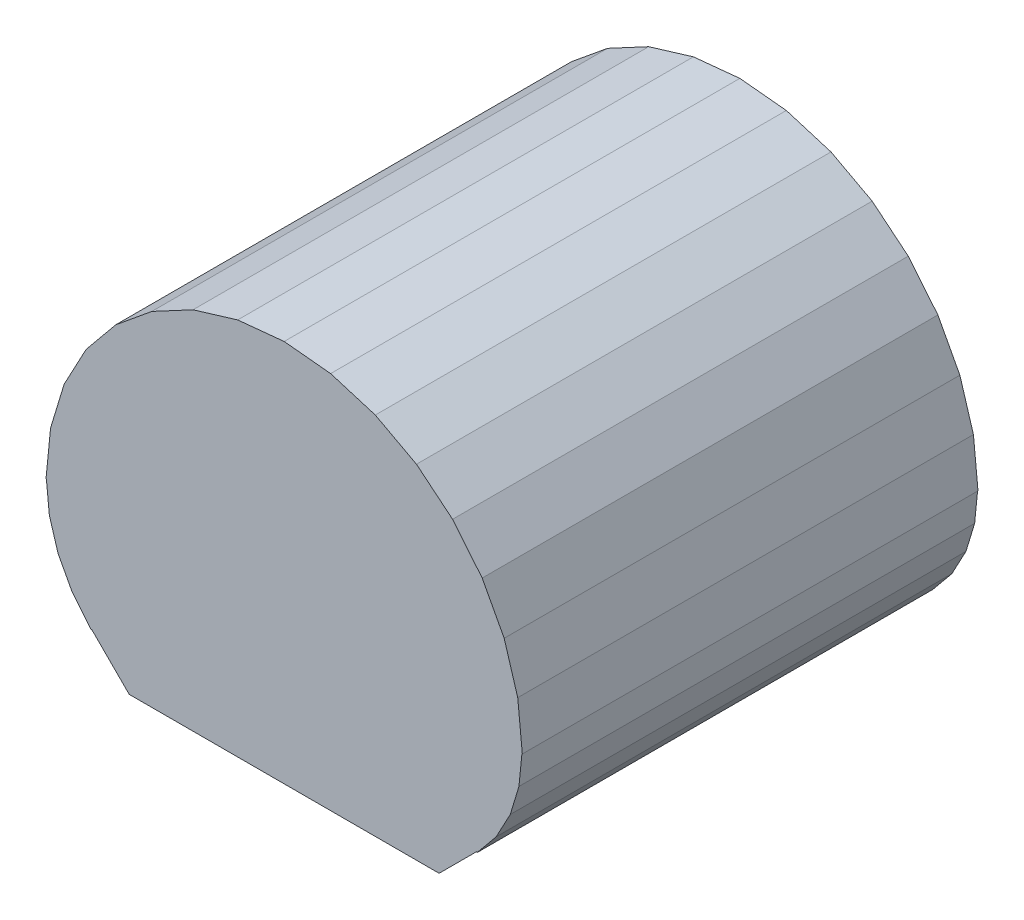
ISO-10303-21;
HEADER;
FILE_DESCRIPTION(('STEP AP214'),'2;1');
FILE_NAME('part.step','',(''),(''),'','','');
FILE_SCHEMA(('AUTOMOTIVE_DESIGN { 1 0 10303 214 1 1 1 1 }'));
ENDSEC;
DATA;
#1=APPLICATION_CONTEXT('core data for automotive mechanical design processes');
#2=APPLICATION_PROTOCOL_DEFINITION('international standard','automotive_design',2000,#1);
#3=PRODUCT_CONTEXT('',#1,'mechanical');
#4=PRODUCT('Part','Part','',(#3));
#5=PRODUCT_RELATED_PRODUCT_CATEGORY('part','',(#4));
#6=PRODUCT_DEFINITION_FORMATION('','',#4);
#7=PRODUCT_DEFINITION_CONTEXT('part definition',#1,'design');
#8=PRODUCT_DEFINITION('design','',#6,#7);
#9=PRODUCT_DEFINITION_SHAPE('','',#8);
#10=(LENGTH_UNIT() NAMED_UNIT(*) SI_UNIT(.MILLI.,.METRE.));
#11=(NAMED_UNIT(*) PLANE_ANGLE_UNIT() SI_UNIT($,.RADIAN.));
#12=(NAMED_UNIT(*) SI_UNIT($,.STERADIAN.) SOLID_ANGLE_UNIT());
#13=UNCERTAINTY_MEASURE_WITH_UNIT(LENGTH_MEASURE(1.E-05),#10,'distance_accuracy_value','');
#14=(GEOMETRIC_REPRESENTATION_CONTEXT(3) GLOBAL_UNCERTAINTY_ASSIGNED_CONTEXT((#13)) GLOBAL_UNIT_ASSIGNED_CONTEXT((#10,
#11,#12)) REPRESENTATION_CONTEXT('',''));
#15=CARTESIAN_POINT('',(0.,0.,0.));
#16=DIRECTION('',(0.,0.,1.));
#17=DIRECTION('',(1.,0.,0.));
#18=AXIS2_PLACEMENT_3D('',#15,#16,#17);
#19=CARTESIAN_POINT('',(0.,2.10181952,0.));
#20=DIRECTION('',(0.0980190132252092,0.995184542206297,0.));
#21=DIRECTION('',(-0.995184542206297,0.0980190132252092,0.));
#22=AXIS2_PLACEMENT_3D('',#19,#20,#21);
#23=PLANE('',#22);
#24=DIRECTION('',(0.,0.,1.));
#25=VECTOR('',#24,1.);
#26=CARTESIAN_POINT('',(0.50978816,2.0516088,0.));
#27=LINE('',#26,#25);
#28=CARTESIAN_POINT('',(0.509788159999998,2.05160879999998,0.));
#29=VERTEX_POINT('',#28);
#30=CARTESIAN_POINT('',(0.509788159999998,2.05160879999998,5.00000016));
#31=VERTEX_POINT('',#30);
#32=EDGE_CURVE('E602',#29,#31,#27,.T.);
#33=ORIENTED_EDGE('',*,*,#32,.F.);
#34=DIRECTION('',(-0.995184542206297,0.0980190132252092,0.));
#35=VECTOR('',#34,1.);
#36=CARTESIAN_POINT('',(0.,2.10181952,0.));
#37=LINE('',#36,#35);
#38=CARTESIAN_POINT('',(0.,2.10181952000003,0.));
#39=VERTEX_POINT('',#38);
#40=EDGE_CURVE('E616',#29,#39,#37,.T.);
#41=ORIENTED_EDGE('',*,*,#40,.T.);
#42=DIRECTION('',(0.,0.,1.));
#43=VECTOR('',#42,1.);
#44=CARTESIAN_POINT('',(0.,2.10181952000005,0.));
#45=LINE('',#44,#43);
#46=CARTESIAN_POINT('',(0.,2.10181952000003,5.00000016));
#47=VERTEX_POINT('',#46);
#48=EDGE_CURVE('E611',#47,#39,#45,.F.);
#49=ORIENTED_EDGE('',*,*,#48,.F.);
#50=DIRECTION('',(-0.995184542206297,0.0980190132252092,0.));
#51=VECTOR('',#50,1.);
#52=CARTESIAN_POINT('',(0.,2.10181952,5.00000016));
#53=LINE('',#52,#51);
#54=EDGE_CURVE('E624',#47,#31,#53,.F.);
#55=ORIENTED_EDGE('',*,*,#54,.T.);
#56=EDGE_LOOP('',(#33,#41,#49,#55));
#57=FACE_BOUND('',#56,.T.);
#58=ADVANCED_FACE('F16',(#57),#23,.T.);
#59=CARTESIAN_POINT('',(-0.50978816,2.0516088,0.));
#60=DIRECTION('',(-0.0980190132252092,0.995184542206297,0.));
#61=DIRECTION('',(-0.995184542206297,-0.0980190132252092,0.));
#62=AXIS2_PLACEMENT_3D('',#59,#60,#61);
#63=PLANE('',#62);
#64=ORIENTED_EDGE('',*,*,#48,.T.);
#65=DIRECTION('',(-0.995184542206297,-0.0980190132252092,0.));
#66=VECTOR('',#65,1.);
#67=CARTESIAN_POINT('',(-0.50978816,2.0516088,0.));
#68=LINE('',#67,#66);
#69=CARTESIAN_POINT('',(-0.509788159999987,2.05160879999996,0.));
#70=VERTEX_POINT('',#69);
#71=EDGE_CURVE('E609',#39,#70,#68,.T.);
#72=ORIENTED_EDGE('',*,*,#71,.T.);
#73=DIRECTION('',(0.,0.,1.));
#74=VECTOR('',#73,1.);
#75=CARTESIAN_POINT('',(-0.509788159999981,2.05160879999994,0.));
#76=LINE('',#75,#74);
#77=CARTESIAN_POINT('',(-0.509788159999983,2.05160879999996,5.00000016));
#78=VERTEX_POINT('',#77);
#79=EDGE_CURVE('E584',#78,#70,#76,.F.);
#80=ORIENTED_EDGE('',*,*,#79,.F.);
#81=DIRECTION('',(-0.995184542206297,-0.0980190132252092,0.));
#82=VECTOR('',#81,1.);
#83=CARTESIAN_POINT('',(-0.50978816,2.0516088,5.00000016));
#84=LINE('',#83,#82);
#85=EDGE_CURVE('E614',#78,#47,#84,.F.);
#86=ORIENTED_EDGE('',*,*,#85,.T.);
#87=EDGE_LOOP('',(#64,#72,#80,#86));
#88=FACE_BOUND('',#87,.T.);
#89=ADVANCED_FACE('F637',(#88),#63,.T.);
#90=CARTESIAN_POINT('',(0.50978816,2.0516088,0.));
#91=DIRECTION('',(0.290282483393017,0.956941001230056,0.));
#92=DIRECTION('',(-0.956941001230056,0.290282483393017,0.));
#93=AXIS2_PLACEMENT_3D('',#90,#91,#92);
#94=PLANE('',#93);
#95=DIRECTION('',(0.,0.,1.));
#96=VECTOR('',#95,1.);
#97=CARTESIAN_POINT('',(0.99998784,1.90290958,0.));
#98=LINE('',#97,#96);
#99=CARTESIAN_POINT('',(0.999987840000006,1.90290958000002,0.));
#100=VERTEX_POINT('',#99);
#101=CARTESIAN_POINT('',(0.999987840000006,1.90290958000002,5.00000016));
#102=VERTEX_POINT('',#101);
#103=EDGE_CURVE('E575',#100,#102,#98,.T.);
#104=ORIENTED_EDGE('',*,*,#103,.F.);
#105=DIRECTION('',(-0.956941001230056,0.290282483393017,0.));
#106=VECTOR('',#105,1.);
#107=CARTESIAN_POINT('',(0.50978816,2.0516088,0.));
#108=LINE('',#107,#106);
#109=EDGE_CURVE('E589',#100,#29,#108,.T.);
#110=ORIENTED_EDGE('',*,*,#109,.T.);
#111=ORIENTED_EDGE('',*,*,#32,.T.);
#112=DIRECTION('',(-0.956941001230056,0.290282483393017,0.));
#113=VECTOR('',#112,1.);
#114=CARTESIAN_POINT('',(0.50978816,2.0516088,5.00000016));
#115=LINE('',#114,#113);
#116=EDGE_CURVE('E598',#31,#102,#115,.F.);
#117=ORIENTED_EDGE('',*,*,#116,.T.);
#118=EDGE_LOOP('',(#104,#110,#111,#117));
#119=FACE_BOUND('',#118,.T.);
#120=ADVANCED_FACE('F661',(#119),#94,.T.);
#121=CARTESIAN_POINT('',(-0.99998784,1.90290958,0.));
#122=DIRECTION('',(-0.290282483393017,0.956941001230056,0.));
#123=DIRECTION('',(-0.956941001230056,-0.290282483393017,0.));
#124=AXIS2_PLACEMENT_3D('',#121,#122,#123);
#125=PLANE('',#124);
#126=ORIENTED_EDGE('',*,*,#79,.T.);
#127=DIRECTION('',(-0.956941001230056,-0.290282483393017,0.));
#128=VECTOR('',#127,1.);
#129=CARTESIAN_POINT('',(-0.99998784,1.90290958,0.));
#130=LINE('',#129,#128);
#131=CARTESIAN_POINT('',(-0.999987839999945,1.9029095799999,0.));
#132=VERTEX_POINT('',#131);
#133=EDGE_CURVE('E582',#70,#132,#130,.T.);
#134=ORIENTED_EDGE('',*,*,#133,.T.);
#135=DIRECTION('',(0.,0.,1.));
#136=VECTOR('',#135,1.);
#137=CARTESIAN_POINT('',(-0.999987839999917,1.90290957999985,0.));
#138=LINE('',#137,#136);
#139=CARTESIAN_POINT('',(-0.999987839999934,1.9029095799999,5.00000016));
#140=VERTEX_POINT('',#139);
#141=EDGE_CURVE('E557',#140,#132,#138,.F.);
#142=ORIENTED_EDGE('',*,*,#141,.F.);
#143=DIRECTION('',(-0.956941001230056,-0.290282483393017,0.));
#144=VECTOR('',#143,1.);
#145=CARTESIAN_POINT('',(-0.99998784,1.90290958,5.00000016));
#146=LINE('',#145,#144);
#147=EDGE_CURVE('E587',#140,#78,#146,.F.);
#148=ORIENTED_EDGE('',*,*,#147,.T.);
#149=EDGE_LOOP('',(#126,#134,#142,#148));
#150=FACE_BOUND('',#149,.T.);
#151=ADVANCED_FACE('F647',(#150),#125,.T.);
#152=CARTESIAN_POINT('',(0.99998784,1.90290958,0.));
#153=DIRECTION('',(0.471397951081191,0.881920615314358,0.));
#154=DIRECTION('',(-0.881920615314358,0.471397951081191,0.));
#155=AXIS2_PLACEMENT_3D('',#152,#153,#154);
#156=PLANE('',#155);
#157=DIRECTION('',(0.,0.,1.));
#158=VECTOR('',#157,1.);
#159=CARTESIAN_POINT('',(1.45175478,1.66143432,0.));
#160=LINE('',#159,#158);
#161=CARTESIAN_POINT('',(1.45175478000003,1.66143432000005,0.));
#162=VERTEX_POINT('',#161);
#163=CARTESIAN_POINT('',(1.45175478000003,1.66143432000005,5.00000016));
#164=VERTEX_POINT('',#163);
#165=EDGE_CURVE('E548',#162,#164,#160,.T.);
#166=ORIENTED_EDGE('',*,*,#165,.F.);
#167=DIRECTION('',(-0.881920615314358,0.471397951081191,0.));
#168=VECTOR('',#167,1.);
#169=CARTESIAN_POINT('',(0.99998784,1.90290958,0.));
#170=LINE('',#169,#168);
#171=EDGE_CURVE('E562',#162,#100,#170,.T.);
#172=ORIENTED_EDGE('',*,*,#171,.T.);
#173=ORIENTED_EDGE('',*,*,#103,.T.);
#174=DIRECTION('',(-0.881920615314358,0.471397951081191,0.));
#175=VECTOR('',#174,1.);
#176=CARTESIAN_POINT('',(0.99998784,1.90290958,5.00000016));
#177=LINE('',#176,#175);
#178=EDGE_CURVE('E571',#102,#164,#177,.F.);
#179=ORIENTED_EDGE('',*,*,#178,.T.);
#180=EDGE_LOOP('',(#166,#172,#173,#179));
#181=FACE_BOUND('',#180,.T.);
#182=ADVANCED_FACE('F664',(#181),#156,.T.);
#183=CARTESIAN_POINT('',(-1.45175478,1.66143432,0.));
#184=DIRECTION('',(-0.471397951081191,0.881920615314358,0.));
#185=DIRECTION('',(-0.881920615314358,-0.471397951081191,0.));
#186=AXIS2_PLACEMENT_3D('',#183,#184,#185);
#187=PLANE('',#186);
#188=ORIENTED_EDGE('',*,*,#141,.T.);
#189=DIRECTION('',(-0.881920615314358,-0.471397951081191,0.));
#190=VECTOR('',#189,1.);
#191=CARTESIAN_POINT('',(-1.45175478,1.66143432,0.));
#192=LINE('',#191,#190);
#193=CARTESIAN_POINT('',(-1.45175477999991,1.66143431999989,0.));
#194=VERTEX_POINT('',#193);
#195=EDGE_CURVE('E555',#132,#194,#192,.T.);
#196=ORIENTED_EDGE('',*,*,#195,.T.);
#197=DIRECTION('',(0.,0.,1.));
#198=VECTOR('',#197,1.);
#199=CARTESIAN_POINT('',(-1.45175477999986,1.66143431999983,0.));
#200=LINE('',#199,#198);
#201=CARTESIAN_POINT('',(-1.4517547799999,1.6614343199999,5.00000016));
#202=VERTEX_POINT('',#201);
#203=EDGE_CURVE('E530',#202,#194,#200,.F.);
#204=ORIENTED_EDGE('',*,*,#203,.F.);
#205=DIRECTION('',(-0.881920615314358,-0.471397951081191,0.));
#206=VECTOR('',#205,1.);
#207=CARTESIAN_POINT('',(-1.45175478,1.66143432,5.00000016));
#208=LINE('',#207,#206);
#209=EDGE_CURVE('E560',#202,#140,#208,.F.);
#210=ORIENTED_EDGE('',*,*,#209,.T.);
#211=EDGE_LOOP('',(#188,#196,#204,#210));
#212=FACE_BOUND('',#211,.T.);
#213=ADVANCED_FACE('F649',(#212),#187,.T.);
#214=CARTESIAN_POINT('',(1.45175478,1.66143432,0.));
#215=DIRECTION('',(0.634395176111987,0.773008900676985,0.));
#216=DIRECTION('',(-0.773008900676985,0.634395176111987,0.));
#217=AXIS2_PLACEMENT_3D('',#214,#215,#216);
#218=PLANE('',#217);
#219=DIRECTION('',(0.,0.,1.));
#220=VECTOR('',#219,1.);
#221=CARTESIAN_POINT('',(1.84773316,1.33646164,0.));
#222=LINE('',#221,#220);
#223=CARTESIAN_POINT('',(1.84773316000005,1.33646164000005,0.));
#224=VERTEX_POINT('',#223);
#225=CARTESIAN_POINT('',(1.84773316000005,1.33646164000005,5.00000016));
#226=VERTEX_POINT('',#225);
#227=EDGE_CURVE('E521',#224,#226,#222,.T.);
#228=ORIENTED_EDGE('',*,*,#227,.F.);
#229=DIRECTION('',(-0.773008900676985,0.634395176111987,0.));
#230=VECTOR('',#229,1.);
#231=CARTESIAN_POINT('',(1.45175478,1.66143432,0.));
#232=LINE('',#231,#230);
#233=EDGE_CURVE('E535',#224,#162,#232,.T.);
#234=ORIENTED_EDGE('',*,*,#233,.T.);
#235=ORIENTED_EDGE('',*,*,#165,.T.);
#236=DIRECTION('',(-0.773008900676985,0.634395176111987,0.));
#237=VECTOR('',#236,1.);
#238=CARTESIAN_POINT('',(1.45175478,1.66143432,5.00000016));
#239=LINE('',#238,#237);
#240=EDGE_CURVE('E544',#164,#226,#239,.F.);
#241=ORIENTED_EDGE('',*,*,#240,.T.);
#242=EDGE_LOOP('',(#228,#234,#235,#241));
#243=FACE_BOUND('',#242,.T.);
#244=ADVANCED_FACE('F668',(#243),#218,.T.);
#245=CARTESIAN_POINT('',(-1.84773316,1.33646164,0.));
#246=DIRECTION('',(-0.634395176111987,0.773008900676985,0.));
#247=DIRECTION('',(-0.773008900676985,-0.634395176111987,0.));
#248=AXIS2_PLACEMENT_3D('',#245,#246,#247);
#249=PLANE('',#248);
#250=ORIENTED_EDGE('',*,*,#203,.T.);
#251=DIRECTION('',(-0.773008900676985,-0.634395176111987,0.));
#252=VECTOR('',#251,1.);
#253=CARTESIAN_POINT('',(-1.84773316,1.33646164,0.));
#254=LINE('',#253,#252);
#255=CARTESIAN_POINT('',(-1.84773316000011,1.33646164000009,0.));
#256=VERTEX_POINT('',#255);
#257=EDGE_CURVE('E528',#194,#256,#254,.T.);
#258=ORIENTED_EDGE('',*,*,#257,.T.);
#259=DIRECTION('',(0.,0.,1.));
#260=VECTOR('',#259,1.);
#261=CARTESIAN_POINT('',(-1.84773316000017,1.33646164000014,0.));
#262=LINE('',#261,#260);
#263=CARTESIAN_POINT('',(-1.84773316000012,1.33646164000008,5.00000016));
#264=VERTEX_POINT('',#263);
#265=EDGE_CURVE('E503',#264,#256,#262,.F.);
#266=ORIENTED_EDGE('',*,*,#265,.F.);
#267=DIRECTION('',(-0.773008900676985,-0.634395176111987,0.));
#268=VECTOR('',#267,1.);
#269=CARTESIAN_POINT('',(-1.84773316,1.33646164,5.00000016));
#270=LINE('',#269,#268);
#271=EDGE_CURVE('E533',#264,#202,#270,.F.);
#272=ORIENTED_EDGE('',*,*,#271,.T.);
#273=EDGE_LOOP('',(#250,#258,#266,#272));
#274=FACE_BOUND('',#273,.T.);
#275=ADVANCED_FACE('F918',(#274),#249,.T.);
#276=CARTESIAN_POINT('',(1.84773316,1.33646164,0.));
#277=DIRECTION('',(0.773008900676985,0.634395176111987,0.));
#278=DIRECTION('',(-0.634395176111987,0.773008900676985,0.));
#279=AXIS2_PLACEMENT_3D('',#276,#277,#278);
#280=PLANE('',#279);
#281=DIRECTION('',(0.,0.,1.));
#282=VECTOR('',#281,1.);
#283=CARTESIAN_POINT('',(2.17270584,0.94048326,0.));
#284=LINE('',#283,#282);
#285=CARTESIAN_POINT('',(2.17270583999995,0.940483259999955,0.));
#286=VERTEX_POINT('',#285);
#287=CARTESIAN_POINT('',(2.17270583999995,0.940483259999955,5.00000016));
#288=VERTEX_POINT('',#287);
#289=EDGE_CURVE('E494',#286,#288,#284,.T.);
#290=ORIENTED_EDGE('',*,*,#289,.F.);
#291=DIRECTION('',(-0.634395176111987,0.773008900676985,0.));
#292=VECTOR('',#291,1.);
#293=CARTESIAN_POINT('',(1.84773316,1.33646164,0.));
#294=LINE('',#293,#292);
#295=EDGE_CURVE('E508',#286,#224,#294,.T.);
#296=ORIENTED_EDGE('',*,*,#295,.T.);
#297=ORIENTED_EDGE('',*,*,#227,.T.);
#298=DIRECTION('',(-0.634395176111987,0.773008900676985,0.));
#299=VECTOR('',#298,1.);
#300=CARTESIAN_POINT('',(1.84773316,1.33646164,5.00000016));
#301=LINE('',#300,#299);
#302=EDGE_CURVE('E517',#226,#288,#301,.F.);
#303=ORIENTED_EDGE('',*,*,#302,.T.);
#304=EDGE_LOOP('',(#290,#296,#297,#303));
#305=FACE_BOUND('',#304,.T.);
#306=ADVANCED_FACE('F674',(#305),#280,.T.);
#307=CARTESIAN_POINT('',(-2.17270584,0.94048326,0.));
#308=DIRECTION('',(-0.773008900676985,0.634395176111987,0.));
#309=DIRECTION('',(-0.634395176111987,-0.773008900676985,0.));
#310=AXIS2_PLACEMENT_3D('',#307,#308,#309);
#311=PLANE('',#310);
#312=ORIENTED_EDGE('',*,*,#265,.T.);
#313=DIRECTION('',(-0.634395176111987,-0.773008900676985,0.));
#314=VECTOR('',#313,1.);
#315=CARTESIAN_POINT('',(-2.17270584,0.94048326,0.));
#316=LINE('',#315,#314);
#317=CARTESIAN_POINT('',(-2.1727058400001,0.940483260000055,0.));
#318=VERTEX_POINT('',#317);
#319=EDGE_CURVE('E501',#256,#318,#316,.T.);
#320=ORIENTED_EDGE('',*,*,#319,.T.);
#321=DIRECTION('',(0.,0.,1.));
#322=VECTOR('',#321,1.);
#323=CARTESIAN_POINT('',(-2.17270584000015,0.940483260000082,0.));
#324=LINE('',#323,#322);
#325=CARTESIAN_POINT('',(-2.17270584000011,0.940483260000046,5.00000016));
#326=VERTEX_POINT('',#325);
#327=EDGE_CURVE('E476',#326,#318,#324,.F.);
#328=ORIENTED_EDGE('',*,*,#327,.F.);
#329=DIRECTION('',(-0.634395176111987,-0.773008900676985,0.));
#330=VECTOR('',#329,1.);
#331=CARTESIAN_POINT('',(-2.17270584,0.94048326,5.00000016));
#332=LINE('',#331,#330);
#333=EDGE_CURVE('E506',#326,#264,#332,.F.);
#334=ORIENTED_EDGE('',*,*,#333,.T.);
#335=EDGE_LOOP('',(#312,#320,#328,#334));
#336=FACE_BOUND('',#335,.T.);
#337=ADVANCED_FACE('F902',(#336),#311,.T.);
#338=CARTESIAN_POINT('',(2.17270584,0.94048326,0.));
#339=DIRECTION('',(0.881920615314358,0.471397951081191,0.));
#340=DIRECTION('',(-0.471397951081191,0.881920615314358,0.));
#341=AXIS2_PLACEMENT_3D('',#338,#339,#340);
#342=PLANE('',#341);
#343=DIRECTION('',(0.,0.,1.));
#344=VECTOR('',#343,1.);
#345=CARTESIAN_POINT('',(2.4141811,0.48871632,0.));
#346=LINE('',#345,#344);
#347=CARTESIAN_POINT('',(2.41418109999995,0.488716319999972,0.));
#348=VERTEX_POINT('',#347);
#349=CARTESIAN_POINT('',(2.41418109999995,0.488716319999972,5.00000016));
#350=VERTEX_POINT('',#349);
#351=EDGE_CURVE('E467',#348,#350,#346,.T.);
#352=ORIENTED_EDGE('',*,*,#351,.F.);
#353=DIRECTION('',(-0.471397951081191,0.881920615314358,0.));
#354=VECTOR('',#353,1.);
#355=CARTESIAN_POINT('',(2.17270584,0.94048326,0.));
#356=LINE('',#355,#354);
#357=EDGE_CURVE('E481',#348,#286,#356,.T.);
#358=ORIENTED_EDGE('',*,*,#357,.T.);
#359=ORIENTED_EDGE('',*,*,#289,.T.);
#360=DIRECTION('',(-0.471397951081191,0.881920615314358,0.));
#361=VECTOR('',#360,1.);
#362=CARTESIAN_POINT('',(2.17270584,0.94048326,5.00000016));
#363=LINE('',#362,#361);
#364=EDGE_CURVE('E490',#288,#350,#363,.F.);
#365=ORIENTED_EDGE('',*,*,#364,.T.);
#366=EDGE_LOOP('',(#352,#358,#359,#365));
#367=FACE_BOUND('',#366,.T.);
#368=ADVANCED_FACE('F677',(#367),#342,.T.);
#369=CARTESIAN_POINT('',(-2.4141811,0.48871632,0.));
#370=DIRECTION('',(-0.881920615314358,0.471397951081191,0.));
#371=DIRECTION('',(-0.471397951081191,-0.881920615314358,0.));
#372=AXIS2_PLACEMENT_3D('',#369,#370,#371);
#373=PLANE('',#372);
#374=ORIENTED_EDGE('',*,*,#327,.T.);
#375=DIRECTION('',(-0.471397951081191,-0.881920615314358,0.));
#376=VECTOR('',#375,1.);
#377=CARTESIAN_POINT('',(-2.4141811,0.48871632,0.));
#378=LINE('',#377,#376);
#379=CARTESIAN_POINT('',(-2.41418110000004,0.488716320000013,0.));
#380=VERTEX_POINT('',#379);
#381=EDGE_CURVE('E474',#318,#380,#378,.T.);
#382=ORIENTED_EDGE('',*,*,#381,.T.);
#383=DIRECTION('',(0.,0.,1.));
#384=VECTOR('',#383,1.);
#385=CARTESIAN_POINT('',(-2.41418110000006,0.488716320000019,0.));
#386=LINE('',#385,#384);
#387=CARTESIAN_POINT('',(-2.41418110000004,0.488716320000009,5.00000016));
#388=VERTEX_POINT('',#387);
#389=EDGE_CURVE('E449',#388,#380,#386,.F.);
#390=ORIENTED_EDGE('',*,*,#389,.F.);
#391=DIRECTION('',(-0.471397951081191,-0.881920615314358,0.));
#392=VECTOR('',#391,1.);
#393=CARTESIAN_POINT('',(-2.4141811,0.48871632,5.00000016));
#394=LINE('',#393,#392);
#395=EDGE_CURVE('E479',#388,#326,#394,.F.);
#396=ORIENTED_EDGE('',*,*,#395,.T.);
#397=EDGE_LOOP('',(#374,#382,#390,#396));
#398=FACE_BOUND('',#397,.T.);
#399=ADVANCED_FACE('F886',(#398),#373,.T.);
#400=CARTESIAN_POINT('',(2.4141811,0.48871632,0.));
#401=DIRECTION('',(0.956941001230056,0.290282483393017,0.));
#402=DIRECTION('',(-0.290282483393017,0.956941001230056,0.));
#403=AXIS2_PLACEMENT_3D('',#400,#401,#402);
#404=PLANE('',#403);
#405=DIRECTION('',(0.,0.,1.));
#406=VECTOR('',#405,1.);
#407=CARTESIAN_POINT('',(2.56288032,-0.001483359999998,0.));
#408=LINE('',#407,#406);
#409=CARTESIAN_POINT('',(2.56288031999998,-0.00148336000000445,0.));
#410=VERTEX_POINT('',#409);
#411=CARTESIAN_POINT('',(2.56288031999998,-0.00148336000000442,5.00000016));
#412=VERTEX_POINT('',#411);
#413=EDGE_CURVE('E440',#410,#412,#408,.T.);
#414=ORIENTED_EDGE('',*,*,#413,.F.);
#415=DIRECTION('',(-0.290282483393017,0.956941001230056,0.));
#416=VECTOR('',#415,1.);
#417=CARTESIAN_POINT('',(2.4141811,0.48871632,0.));
#418=LINE('',#417,#416);
#419=EDGE_CURVE('E454',#410,#348,#418,.T.);
#420=ORIENTED_EDGE('',*,*,#419,.T.);
#421=ORIENTED_EDGE('',*,*,#351,.T.);
#422=DIRECTION('',(-0.290282483393017,0.956941001230056,0.));
#423=VECTOR('',#422,1.);
#424=CARTESIAN_POINT('',(2.4141811,0.48871632,5.00000016));
#425=LINE('',#424,#423);
#426=EDGE_CURVE('E463',#350,#412,#425,.F.);
#427=ORIENTED_EDGE('',*,*,#426,.T.);
#428=EDGE_LOOP('',(#414,#420,#421,#427));
#429=FACE_BOUND('',#428,.T.);
#430=ADVANCED_FACE('F680',(#429),#404,.T.);
#431=CARTESIAN_POINT('',(-2.56288032,-0.001483359999998,0.));
#432=DIRECTION('',(-0.956941001230056,0.290282483393017,0.));
#433=DIRECTION('',(-0.290282483393017,-0.956941001230056,0.));
#434=AXIS2_PLACEMENT_3D('',#431,#432,#433);
#435=PLANE('',#434);
#436=ORIENTED_EDGE('',*,*,#389,.T.);
#437=DIRECTION('',(-0.290282483393017,-0.956941001230056,0.));
#438=VECTOR('',#437,1.);
#439=CARTESIAN_POINT('',(-2.56288032,-0.001483359999998,0.));
#440=LINE('',#439,#438);
#441=CARTESIAN_POINT('',(-2.56288031999997,-0.00148336000000108,0.));
#442=VERTEX_POINT('',#441);
#443=EDGE_CURVE('E447',#380,#442,#440,.T.);
#444=ORIENTED_EDGE('',*,*,#443,.T.);
#445=DIRECTION('',(0.,0.,1.));
#446=VECTOR('',#445,1.);
#447=CARTESIAN_POINT('',(-2.56288031999995,-0.00148336000000261,0.));
#448=LINE('',#447,#446);
#449=CARTESIAN_POINT('',(-2.56288031999997,-0.00148335999999819,5.00000016));
#450=VERTEX_POINT('',#449);
#451=EDGE_CURVE('E422',#450,#442,#448,.F.);
#452=ORIENTED_EDGE('',*,*,#451,.F.);
#453=DIRECTION('',(-0.290282483393017,-0.956941001230056,0.));
#454=VECTOR('',#453,1.);
#455=CARTESIAN_POINT('',(-2.56288032,-0.001483359999998,5.00000016));
#456=LINE('',#455,#454);
#457=EDGE_CURVE('E452',#450,#388,#456,.F.);
#458=ORIENTED_EDGE('',*,*,#457,.T.);
#459=EDGE_LOOP('',(#436,#444,#452,#458));
#460=FACE_BOUND('',#459,.T.);
#461=ADVANCED_FACE('F870',(#460),#435,.T.);
#462=CARTESIAN_POINT('',(2.56288032,-0.001483359999998,0.));
#463=DIRECTION('',(0.995184542206297,0.0980190132252092,0.));
#464=DIRECTION('',(-0.0980190132252092,0.995184542206297,0.));
#465=AXIS2_PLACEMENT_3D('',#462,#463,#464);
#466=PLANE('',#465);
#467=DIRECTION('',(0.,0.,-1.));
#468=VECTOR('',#467,1.);
#469=CARTESIAN_POINT('',(2.61309104,-0.51127152,0.));
#470=LINE('',#469,#468);
#471=CARTESIAN_POINT('',(2.61309104000002,-0.511271519999998,0.));
#472=VERTEX_POINT('',#471);
#473=CARTESIAN_POINT('',(2.61309104000002,-0.511271519999998,5.00000016));
#474=VERTEX_POINT('',#473);
#475=EDGE_CURVE('E413',#472,#474,#470,.F.);
#476=ORIENTED_EDGE('',*,*,#475,.F.);
#477=DIRECTION('',(-0.0980190132252092,0.995184542206297,0.));
#478=VECTOR('',#477,1.);
#479=CARTESIAN_POINT('',(2.56288032,-0.001483359999998,0.));
#480=LINE('',#479,#478);
#481=EDGE_CURVE('E427',#472,#410,#480,.T.);
#482=ORIENTED_EDGE('',*,*,#481,.T.);
#483=ORIENTED_EDGE('',*,*,#413,.T.);
#484=DIRECTION('',(-0.0980190132252092,0.995184542206297,0.));
#485=VECTOR('',#484,1.);
#486=CARTESIAN_POINT('',(2.56288032,-0.001483359999998,5.00000016));
#487=LINE('',#486,#485);
#488=EDGE_CURVE('E436',#412,#474,#487,.F.);
#489=ORIENTED_EDGE('',*,*,#488,.T.);
#490=EDGE_LOOP('',(#476,#482,#483,#489));
#491=FACE_BOUND('',#490,.T.);
#492=ADVANCED_FACE('F684',(#491),#466,.T.);
#493=CARTESIAN_POINT('',(-2.61309104,-0.51127152,0.));
#494=DIRECTION('',(-0.995184542206297,0.0980190132252092,0.));
#495=DIRECTION('',(-0.0980190132252092,-0.995184542206297,0.));
#496=AXIS2_PLACEMENT_3D('',#493,#494,#495);
#497=PLANE('',#496);
#498=ORIENTED_EDGE('',*,*,#451,.T.);
#499=DIRECTION('',(-0.0980190132252092,-0.995184542206297,0.));
#500=VECTOR('',#499,1.);
#501=CARTESIAN_POINT('',(-2.61309104,-0.51127152,0.));
#502=LINE('',#501,#500);
#503=CARTESIAN_POINT('',(-2.61309104,-0.51127152,0.));
#504=VERTEX_POINT('',#503);
#505=EDGE_CURVE('E420',#442,#504,#502,.T.);
#506=ORIENTED_EDGE('',*,*,#505,.T.);
#507=DIRECTION('',(0.,0.,-1.));
#508=VECTOR('',#507,1.);
#509=CARTESIAN_POINT('',(-2.61309104,-0.51127152,0.));
#510=LINE('',#509,#508);
#511=CARTESIAN_POINT('',(-2.61309104,-0.51127152,5.00000016));
#512=VERTEX_POINT('',#511);
#513=EDGE_CURVE('E395',#512,#504,#510,.T.);
#514=ORIENTED_EDGE('',*,*,#513,.F.);
#515=DIRECTION('',(-0.0980190132252092,-0.995184542206297,0.));
#516=VECTOR('',#515,1.);
#517=CARTESIAN_POINT('',(-2.61309104,-0.51127152,5.00000016));
#518=LINE('',#517,#516);
#519=EDGE_CURVE('E425',#512,#450,#518,.F.);
#520=ORIENTED_EDGE('',*,*,#519,.T.);
#521=EDGE_LOOP('',(#498,#506,#514,#520));
#522=FACE_BOUND('',#521,.T.);
#523=ADVANCED_FACE('F854',(#522),#497,.T.);
#524=CARTESIAN_POINT('',(2.61309104,-0.51127152,0.));
#525=DIRECTION('',(0.,-1.,0.));
#526=DIRECTION('',(0.,0.,-1.));
#527=AXIS2_PLACEMENT_3D('',#524,#525,#526);
#528=PLANE('',#527);
#529=DIRECTION('',(0.,0.,1.));
#530=VECTOR('',#529,1.);
#531=CARTESIAN_POINT('',(2.60856984,-0.51127152,0.));
#532=LINE('',#531,#530);
#533=CARTESIAN_POINT('',(2.60856984,-0.51127152,0.));
#534=VERTEX_POINT('',#533);
#535=CARTESIAN_POINT('',(2.60856984,-0.51127152,5.00000016));
#536=VERTEX_POINT('',#535);
#537=EDGE_CURVE('E386',#534,#536,#532,.T.);
#538=ORIENTED_EDGE('',*,*,#537,.F.);
#539=DIRECTION('',(1.,0.,0.));
#540=VECTOR('',#539,1.);
#541=CARTESIAN_POINT('',(2.61309104,-0.51127152,0.));
#542=LINE('',#541,#540);
#543=EDGE_CURVE('E400',#534,#472,#542,.T.);
#544=ORIENTED_EDGE('',*,*,#543,.T.);
#545=ORIENTED_EDGE('',*,*,#475,.T.);
#546=DIRECTION('',(1.,0.,0.));
#547=VECTOR('',#546,1.);
#548=CARTESIAN_POINT('',(2.61309104,-0.51127152,5.00000016));
#549=LINE('',#548,#547);
#550=EDGE_CURVE('E409',#474,#536,#549,.F.);
#551=ORIENTED_EDGE('',*,*,#550,.T.);
#552=EDGE_LOOP('',(#538,#544,#545,#551));
#553=FACE_BOUND('',#552,.T.);
#554=ADVANCED_FACE('F690',(#553),#528,.T.);
#555=CARTESIAN_POINT('',(-2.60856984,-0.51127152,0.));
#556=DIRECTION('',(0.,-1.,0.));
#557=DIRECTION('',(0.,0.,-1.));
#558=AXIS2_PLACEMENT_3D('',#555,#556,#557);
#559=PLANE('',#558);
#560=ORIENTED_EDGE('',*,*,#513,.T.);
#561=DIRECTION('',(1.,0.,0.));
#562=VECTOR('',#561,1.);
#563=CARTESIAN_POINT('',(-2.60856984,-0.51127152,0.));
#564=LINE('',#563,#562);
#565=CARTESIAN_POINT('',(-2.60856983999999,-0.511271519999999,0.));
#566=VERTEX_POINT('',#565);
#567=EDGE_CURVE('E393',#504,#566,#564,.T.);
#568=ORIENTED_EDGE('',*,*,#567,.T.);
#569=DIRECTION('',(0.,0.,1.));
#570=VECTOR('',#569,1.);
#571=CARTESIAN_POINT('',(-2.60856983999999,-0.511271519999999,0.));
#572=LINE('',#571,#570);
#573=CARTESIAN_POINT('',(-2.60856983999999,-0.511271519999999,5.00000016));
#574=VERTEX_POINT('',#573);
#575=EDGE_CURVE('E368',#574,#566,#572,.F.);
#576=ORIENTED_EDGE('',*,*,#575,.F.);
#577=DIRECTION('',(1.,0.,0.));
#578=VECTOR('',#577,1.);
#579=CARTESIAN_POINT('',(-2.60856984,-0.51127152,5.00000016));
#580=LINE('',#579,#578);
#581=EDGE_CURVE('E398',#574,#512,#580,.F.);
#582=ORIENTED_EDGE('',*,*,#581,.T.);
#583=EDGE_LOOP('',(#560,#568,#576,#582));
#584=FACE_BOUND('',#583,.T.);
#585=ADVANCED_FACE('F838',(#584),#559,.T.);
#586=CARTESIAN_POINT('',(2.60856984,-0.51127152,0.));
#587=DIRECTION('',(0.995185019875911,-0.0980141633366413,0.));
#588=DIRECTION('',(0.0980141633366413,0.995185019875911,0.));
#589=AXIS2_PLACEMENT_3D('',#586,#587,#588);
#590=PLANE('',#589);
#591=DIRECTION('',(0.,0.,1.));
#592=VECTOR('',#591,1.);
#593=CARTESIAN_POINT('',(2.5763982,-0.83792568,0.));
#594=LINE('',#593,#592);
#595=CARTESIAN_POINT('',(2.5763982,-0.83792568,0.));
#596=VERTEX_POINT('',#595);
#597=CARTESIAN_POINT('',(2.5763982,-0.83792568,5.00000016));
#598=VERTEX_POINT('',#597);
#599=EDGE_CURVE('E359',#596,#598,#594,.T.);
#600=ORIENTED_EDGE('',*,*,#599,.F.);
#601=DIRECTION('',(0.0980141633366413,0.995185019875911,0.));
#602=VECTOR('',#601,1.);
#603=CARTESIAN_POINT('',(2.60856984,-0.51127152,0.));
#604=LINE('',#603,#602);
#605=EDGE_CURVE('E373',#596,#534,#604,.T.);
#606=ORIENTED_EDGE('',*,*,#605,.T.);
#607=ORIENTED_EDGE('',*,*,#537,.T.);
#608=DIRECTION('',(0.0980141633366413,0.995185019875911,0.));
#609=VECTOR('',#608,1.);
#610=CARTESIAN_POINT('',(2.60856984,-0.51127152,5.00000016));
#611=LINE('',#610,#609);
#612=EDGE_CURVE('E382',#536,#598,#611,.F.);
#613=ORIENTED_EDGE('',*,*,#612,.T.);
#614=EDGE_LOOP('',(#600,#606,#607,#613));
#615=FACE_BOUND('',#614,.T.);
#616=ADVANCED_FACE('F693',(#615),#590,.T.);
#617=CARTESIAN_POINT('',(-2.5763982,-0.83792568,0.));
#618=DIRECTION('',(-0.995185019875913,-0.0980141633366314,0.));
#619=DIRECTION('',(0.0980141633366313,-0.995185019875912,0.));
#620=AXIS2_PLACEMENT_3D('',#617,#618,#619);
#621=PLANE('',#620);
#622=ORIENTED_EDGE('',*,*,#575,.T.);
#623=DIRECTION('',(0.0980141633366313,-0.995185019875912,0.));
#624=VECTOR('',#623,1.);
#625=CARTESIAN_POINT('',(-2.5763982,-0.83792568,0.));
#626=LINE('',#625,#624);
#627=CARTESIAN_POINT('',(-2.57639819999998,-0.837925679999995,0.));
#628=VERTEX_POINT('',#627);
#629=EDGE_CURVE('E366',#566,#628,#626,.T.);
#630=ORIENTED_EDGE('',*,*,#629,.T.);
#631=DIRECTION('',(0.,0.,1.));
#632=VECTOR('',#631,1.);
#633=CARTESIAN_POINT('',(-2.57639819999998,-0.837925679999993,0.));
#634=LINE('',#633,#632);
#635=CARTESIAN_POINT('',(-2.57639819999998,-0.837925679999994,5.00000016));
#636=VERTEX_POINT('',#635);
#637=EDGE_CURVE('E341',#636,#628,#634,.F.);
#638=ORIENTED_EDGE('',*,*,#637,.F.);
#639=DIRECTION('',(0.0980141633366313,-0.995185019875912,0.));
#640=VECTOR('',#639,1.);
#641=CARTESIAN_POINT('',(-2.5763982,-0.83792568,5.00000016));
#642=LINE('',#641,#640);
#643=EDGE_CURVE('E371',#636,#574,#642,.F.);
#644=ORIENTED_EDGE('',*,*,#643,.T.);
#645=EDGE_LOOP('',(#622,#630,#638,#644));
#646=FACE_BOUND('',#645,.T.);
#647=ADVANCED_FACE('F822',(#646),#621,.T.);
#648=CARTESIAN_POINT('',(2.5763982,-0.83792568,0.));
#649=DIRECTION('',(0.956939169757868,-0.29028852092896,0.));
#650=DIRECTION('',(0.29028852092896,0.956939169757868,0.));
#651=AXIS2_PLACEMENT_3D('',#648,#649,#650);
#652=PLANE('',#651);
#653=DIRECTION('',(0.,0.,1.));
#654=VECTOR('',#653,1.);
#655=CARTESIAN_POINT('',(2.48111518,-1.15202716,0.));
#656=LINE('',#655,#654);
#657=CARTESIAN_POINT('',(2.48111518000001,-1.15202716,0.));
#658=VERTEX_POINT('',#657);
#659=CARTESIAN_POINT('',(2.48111518000001,-1.15202716,5.00000016));
#660=VERTEX_POINT('',#659);
#661=EDGE_CURVE('E332',#658,#660,#656,.T.);
#662=ORIENTED_EDGE('',*,*,#661,.F.);
#663=DIRECTION('',(0.29028852092896,0.956939169757868,0.));
#664=VECTOR('',#663,1.);
#665=CARTESIAN_POINT('',(2.5763982,-0.83792568,0.));
#666=LINE('',#665,#664);
#667=EDGE_CURVE('E346',#658,#596,#666,.T.);
#668=ORIENTED_EDGE('',*,*,#667,.T.);
#669=ORIENTED_EDGE('',*,*,#599,.T.);
#670=DIRECTION('',(0.29028852092896,0.956939169757868,0.));
#671=VECTOR('',#670,1.);
#672=CARTESIAN_POINT('',(2.5763982,-0.83792568,5.00000016));
#673=LINE('',#672,#671);
#674=EDGE_CURVE('E355',#598,#660,#673,.F.);
#675=ORIENTED_EDGE('',*,*,#674,.T.);
#676=EDGE_LOOP('',(#662,#668,#669,#675));
#677=FACE_BOUND('',#676,.T.);
#678=ADVANCED_FACE('F696',(#677),#652,.T.);
#679=CARTESIAN_POINT('',(-2.48111518,-1.15202716,0.));
#680=DIRECTION('',(-0.956939169757868,-0.29028852092896,0.));
#681=DIRECTION('',(0.29028852092896,-0.956939169757868,0.));
#682=AXIS2_PLACEMENT_3D('',#679,#680,#681);
#683=PLANE('',#682);
#684=ORIENTED_EDGE('',*,*,#637,.T.);
#685=DIRECTION('',(0.29028852092896,-0.956939169757868,0.));
#686=VECTOR('',#685,1.);
#687=CARTESIAN_POINT('',(-2.48111518,-1.15202716,0.));
#688=LINE('',#687,#686);
#689=CARTESIAN_POINT('',(-2.48111518000001,-1.15202716,0.));
#690=VERTEX_POINT('',#689);
#691=EDGE_CURVE('E339',#628,#690,#688,.T.);
#692=ORIENTED_EDGE('',*,*,#691,.T.);
#693=DIRECTION('',(0.,0.,1.));
#694=VECTOR('',#693,1.);
#695=CARTESIAN_POINT('',(-2.48111518000001,-1.15202716,0.));
#696=LINE('',#695,#694);
#697=CARTESIAN_POINT('',(-2.48111518000001,-1.15202716,5.00000016));
#698=VERTEX_POINT('',#697);
#699=EDGE_CURVE('E314',#698,#690,#696,.F.);
#700=ORIENTED_EDGE('',*,*,#699,.F.);
#701=DIRECTION('',(0.29028852092896,-0.956939169757868,0.));
#702=VECTOR('',#701,1.);
#703=CARTESIAN_POINT('',(-2.48111518,-1.15202716,5.00000016));
#704=LINE('',#703,#702);
#705=EDGE_CURVE('E344',#698,#636,#704,.F.);
#706=ORIENTED_EDGE('',*,*,#705,.T.);
#707=EDGE_LOOP('',(#684,#692,#700,#706));
#708=FACE_BOUND('',#707,.T.);
#709=ADVANCED_FACE('F806',(#708),#683,.T.);
#710=CARTESIAN_POINT('',(2.48111518,-1.15202716,0.));
#711=DIRECTION('',(0.881921795624982,-0.471395742875991,0.));
#712=DIRECTION('',(0.471395742875991,0.881921795624982,0.));
#713=AXIS2_PLACEMENT_3D('',#710,#711,#712);
#714=PLANE('',#713);
#715=DIRECTION('',(0.,0.,1.));
#716=VECTOR('',#715,1.);
#717=CARTESIAN_POINT('',(2.326386,-1.44150588,0.));
#718=LINE('',#717,#716);
#719=CARTESIAN_POINT('',(2.326386,-1.44150588,0.));
#720=VERTEX_POINT('',#719);
#721=CARTESIAN_POINT('',(2.326386,-1.44150588,5.00000016));
#722=VERTEX_POINT('',#721);
#723=EDGE_CURVE('E305',#720,#722,#718,.T.);
#724=ORIENTED_EDGE('',*,*,#723,.F.);
#725=DIRECTION('',(0.471395742875991,0.881921795624982,0.));
#726=VECTOR('',#725,1.);
#727=CARTESIAN_POINT('',(2.48111518,-1.15202716,0.));
#728=LINE('',#727,#726);
#729=EDGE_CURVE('E319',#720,#658,#728,.T.);
#730=ORIENTED_EDGE('',*,*,#729,.T.);
#731=ORIENTED_EDGE('',*,*,#661,.T.);
#732=DIRECTION('',(0.471395742875991,0.881921795624982,0.));
#733=VECTOR('',#732,1.);
#734=CARTESIAN_POINT('',(2.48111518,-1.15202716,5.00000016));
#735=LINE('',#734,#733);
#736=EDGE_CURVE('E328',#660,#722,#735,.F.);
#737=ORIENTED_EDGE('',*,*,#736,.T.);
#738=EDGE_LOOP('',(#724,#730,#731,#737));
#739=FACE_BOUND('',#738,.T.);
#740=ADVANCED_FACE('F700',(#739),#714,.T.);
#741=CARTESIAN_POINT('',(-2.326386,-1.44150588,0.));
#742=DIRECTION('',(-0.881921795624982,-0.471395742875991,0.));
#743=DIRECTION('',(0.471395742875991,-0.881921795624982,0.));
#744=AXIS2_PLACEMENT_3D('',#741,#742,#743);
#745=PLANE('',#744);
#746=ORIENTED_EDGE('',*,*,#699,.T.);
#747=DIRECTION('',(0.471395742875991,-0.881921795624982,0.));
#748=VECTOR('',#747,1.);
#749=CARTESIAN_POINT('',(-2.326386,-1.44150588,0.));
#750=LINE('',#749,#748);
#751=CARTESIAN_POINT('',(-2.32638599999998,-1.44150587999998,0.));
#752=VERTEX_POINT('',#751);
#753=EDGE_CURVE('E312',#690,#752,#750,.T.);
#754=ORIENTED_EDGE('',*,*,#753,.T.);
#755=DIRECTION('',(0.,0.,1.));
#756=VECTOR('',#755,1.);
#757=CARTESIAN_POINT('',(-2.32638599999997,-1.44150587999998,0.));
#758=LINE('',#757,#756);
#759=CARTESIAN_POINT('',(-2.32638599999998,-1.44150587999998,5.00000016));
#760=VERTEX_POINT('',#759);
#761=EDGE_CURVE('E287',#760,#752,#758,.F.);
#762=ORIENTED_EDGE('',*,*,#761,.F.);
#763=DIRECTION('',(0.471395742875991,-0.881921795624982,0.));
#764=VECTOR('',#763,1.);
#765=CARTESIAN_POINT('',(-2.326386,-1.44150588,5.00000016));
#766=LINE('',#765,#764);
#767=EDGE_CURVE('E317',#760,#698,#766,.F.);
#768=ORIENTED_EDGE('',*,*,#767,.T.);
#769=EDGE_LOOP('',(#746,#754,#762,#768));
#770=FACE_BOUND('',#769,.T.);
#771=ADVANCED_FACE('F790',(#770),#745,.T.);
#772=CARTESIAN_POINT('',(2.326386,-1.44150588,0.));
#773=DIRECTION('',(0.773010705538929,-0.634392976885942,0.));
#774=DIRECTION('',(0.634392976885942,0.773010705538929,0.));
#775=AXIS2_PLACEMENT_3D('',#772,#773,#774);
#776=PLANE('',#775);
#777=DIRECTION('',(0.,0.,1.));
#778=VECTOR('',#777,1.);
#779=CARTESIAN_POINT('',(2.1181568,-1.6952341,0.));
#780=LINE('',#779,#778);
#781=CARTESIAN_POINT('',(2.11815680000001,-1.69523410000001,0.));
#782=VERTEX_POINT('',#781);
#783=CARTESIAN_POINT('',(2.11815680000001,-1.69523410000001,5.00000016));
#784=VERTEX_POINT('',#783);
#785=EDGE_CURVE('E275',#782,#784,#780,.T.);
#786=ORIENTED_EDGE('',*,*,#785,.F.);
#787=DIRECTION('',(0.634392976885942,0.773010705538929,0.));
#788=VECTOR('',#787,1.);
#789=CARTESIAN_POINT('',(2.326386,-1.44150588,0.));
#790=LINE('',#789,#788);
#791=EDGE_CURVE('E292',#782,#720,#790,.T.);
#792=ORIENTED_EDGE('',*,*,#791,.T.);
#793=ORIENTED_EDGE('',*,*,#723,.T.);
#794=DIRECTION('',(0.634392976885942,0.773010705538929,0.));
#795=VECTOR('',#794,1.);
#796=CARTESIAN_POINT('',(2.326386,-1.44150588,5.00000016));
#797=LINE('',#796,#795);
#798=EDGE_CURVE('E301',#722,#784,#797,.F.);
#799=ORIENTED_EDGE('',*,*,#798,.T.);
#800=EDGE_LOOP('',(#786,#792,#793,#799));
#801=FACE_BOUND('',#800,.T.);
#802=ADVANCED_FACE('F705',(#801),#776,.T.);
#803=CARTESIAN_POINT('',(-2.1181568,-1.6952341,0.));
#804=DIRECTION('',(-0.773010705538929,-0.634392976885942,0.));
#805=DIRECTION('',(0.634392976885942,-0.773010705538929,0.));
#806=AXIS2_PLACEMENT_3D('',#803,#804,#805);
#807=PLANE('',#806);
#808=ORIENTED_EDGE('',*,*,#761,.T.);
#809=DIRECTION('',(0.634392976885942,-0.773010705538929,0.));
#810=VECTOR('',#809,1.);
#811=CARTESIAN_POINT('',(-2.1181568,-1.6952341,0.));
#812=LINE('',#811,#810);
#813=CARTESIAN_POINT('',(-2.1181568,-1.6952341,0.));
#814=VERTEX_POINT('',#813);
#815=EDGE_CURVE('E285',#752,#814,#812,.T.);
#816=ORIENTED_EDGE('',*,*,#815,.T.);
#817=DIRECTION('',(0.,0.,1.));
#818=VECTOR('',#817,1.);
#819=CARTESIAN_POINT('',(-2.1181568,-1.6952341,0.));
#820=LINE('',#819,#818);
#821=CARTESIAN_POINT('',(-2.1181568,-1.6952341,5.00000016));
#822=VERTEX_POINT('',#821);
#823=EDGE_CURVE('E265',#822,#814,#820,.F.);
#824=ORIENTED_EDGE('',*,*,#823,.F.);
#825=DIRECTION('',(0.634392976885942,-0.773010705538929,0.));
#826=VECTOR('',#825,1.);
#827=CARTESIAN_POINT('',(-2.1181568,-1.6952341,5.00000016));
#828=LINE('',#827,#826);
#829=EDGE_CURVE('E290',#822,#760,#828,.F.);
#830=ORIENTED_EDGE('',*,*,#829,.T.);
#831=EDGE_LOOP('',(#808,#816,#824,#830));
#832=FACE_BOUND('',#831,.T.);
#833=ADVANCED_FACE('F774',(#832),#807,.T.);
#834=CARTESIAN_POINT('',(2.1181568,-1.6952341,0.));
#835=DIRECTION('',(-0.707106781187048,-0.707106781186048,0.));
#836=DIRECTION('',(0.707106781186048,-0.707106781187048,0.));
#837=AXIS2_PLACEMENT_3D('',#834,#835,#836);
#838=PLANE('',#837);
#839=DIRECTION('',(0.,0.,1.));
#840=VECTOR('',#839,1.);
#841=CARTESIAN_POINT('',(2.1124545,-1.6895318,0.));
#842=LINE('',#841,#840);
#843=CARTESIAN_POINT('',(2.1124545,-1.6895318,0.));
#844=VERTEX_POINT('',#843);
#845=CARTESIAN_POINT('',(2.1124545,-1.6895318,5.00000016));
#846=VERTEX_POINT('',#845);
#847=EDGE_CURVE('E19',#844,#846,#842,.T.);
#848=ORIENTED_EDGE('',*,*,#847,.F.);
#849=DIRECTION('',(0.707106781186048,-0.707106781187048,0.));
#850=VECTOR('',#849,1.);
#851=CARTESIAN_POINT('',(2.1181568,-1.6952341,0.));
#852=LINE('',#851,#850);
#853=EDGE_CURVE('E214',#844,#782,#852,.T.);
#854=ORIENTED_EDGE('',*,*,#853,.T.);
#855=ORIENTED_EDGE('',*,*,#785,.T.);
#856=DIRECTION('',(0.707106781186048,-0.707106781187048,0.));
#857=VECTOR('',#856,1.);
#858=CARTESIAN_POINT('',(2.1181568,-1.6952341,5.00000016));
#859=LINE('',#858,#857);
#860=EDGE_CURVE('E272',#784,#846,#859,.F.);
#861=ORIENTED_EDGE('',*,*,#860,.T.);
#862=EDGE_LOOP('',(#848,#854,#855,#861));
#863=FACE_BOUND('',#862,.T.);
#864=ADVANCED_FACE('F707',(#863),#838,.T.);
#865=CARTESIAN_POINT('',(-2.11242656,-1.68955974,0.));
#866=DIRECTION('',(0.703633669140129,-0.710562917448131,0.));
#867=DIRECTION('',(0.710562917448131,0.703633669140129,0.));
#868=AXIS2_PLACEMENT_3D('',#865,#866,#867);
#869=PLANE('',#868);
#870=ORIENTED_EDGE('',*,*,#823,.T.);
#871=DIRECTION('',(0.710562917448131,0.703633669140129,0.));
#872=VECTOR('',#871,1.);
#873=CARTESIAN_POINT('',(-2.11242656,-1.68955974,0.));
#874=LINE('',#873,#872);
#875=CARTESIAN_POINT('',(-2.11242656,-1.68955974,0.));
#876=VERTEX_POINT('',#875);
#877=EDGE_CURVE('E263',#814,#876,#874,.T.);
#878=ORIENTED_EDGE('',*,*,#877,.T.);
#879=DIRECTION('',(0.,0.,1.));
#880=VECTOR('',#879,1.);
#881=CARTESIAN_POINT('',(-2.11242656,-1.68955974,0.));
#882=LINE('',#881,#880);
#883=CARTESIAN_POINT('',(-2.11242656,-1.68955974,5.00000016));
#884=VERTEX_POINT('',#883);
#885=EDGE_CURVE('E235',#884,#876,#882,.F.);
#886=ORIENTED_EDGE('',*,*,#885,.F.);
#887=DIRECTION('',(0.710562917448131,0.703633669140129,0.));
#888=VECTOR('',#887,1.);
#889=CARTESIAN_POINT('',(-2.11242656,-1.68955974,5.00000016));
#890=LINE('',#889,#888);
#891=EDGE_CURVE('E268',#884,#822,#890,.F.);
#892=ORIENTED_EDGE('',*,*,#891,.T.);
#893=EDGE_LOOP('',(#870,#878,#886,#892));
#894=FACE_BOUND('',#893,.T.);
#895=ADVANCED_FACE('F712',(#894),#869,.T.);
#896=CARTESIAN_POINT('',(2.11242656,-1.68955974,0.));
#897=DIRECTION('',(0.707106781186548,-0.707106781186548,0.));
#898=DIRECTION('',(0.707106781186548,0.707106781186548,0.));
#899=AXIS2_PLACEMENT_3D('',#896,#897,#898);
#900=PLANE('',#899);
#901=DIRECTION('',(0.,0.,1.));
#902=VECTOR('',#901,1.);
#903=CARTESIAN_POINT('',(1.70020742,-2.10177888,0.));
#904=LINE('',#903,#902);
#905=CARTESIAN_POINT('',(1.70020742,-2.10177888,0.));
#906=VERTEX_POINT('',#905);
#907=CARTESIAN_POINT('',(1.70020742,-2.10177888,5.00000016));
#908=VERTEX_POINT('',#907);
#909=EDGE_CURVE('E228',#906,#908,#904,.T.);
#910=ORIENTED_EDGE('',*,*,#909,.F.);
#911=DIRECTION('',(-0.707106781186548,-0.707106781186547,0.));
#912=VECTOR('',#911,1.);
#913=CARTESIAN_POINT('',(2.11242656,-1.68955974,0.));
#914=LINE('',#913,#912);
#915=EDGE_CURVE('E218',#844,#906,#914,.T.);
#916=ORIENTED_EDGE('',*,*,#915,.F.);
#917=ORIENTED_EDGE('',*,*,#847,.T.);
#918=DIRECTION('',(0.707106781186548,0.707106781186548,0.));
#919=VECTOR('',#918,1.);
#920=CARTESIAN_POINT('',(2.11242656,-1.68955974,5.00000016));
#921=LINE('',#920,#919);
#922=EDGE_CURVE('E254',#846,#908,#921,.F.);
#923=ORIENTED_EDGE('',*,*,#922,.T.);
#924=EDGE_LOOP('',(#910,#916,#917,#923));
#925=FACE_BOUND('',#924,.T.);
#926=ADVANCED_FACE('F710',(#925),#900,.T.);
#927=CARTESIAN_POINT('',(-1.70038522,-2.10160108,0.));
#928=DIRECTION('',(-0.707106781186548,-0.707106781186548,0.));
#929=DIRECTION('',(0.707106781186548,-0.707106781186548,0.));
#930=AXIS2_PLACEMENT_3D('',#927,#928,#929);
#931=PLANE('',#930);
#932=ORIENTED_EDGE('',*,*,#885,.T.);
#933=DIRECTION('',(-0.707106781186548,0.707106781186547,0.));
#934=VECTOR('',#933,1.);
#935=CARTESIAN_POINT('',(-1.70038522,-2.10160108,0.));
#936=LINE('',#935,#934);
#937=CARTESIAN_POINT('',(-1.70034285158515,-2.10163705745319,0.));
#938=VERTEX_POINT('',#937);
#939=EDGE_CURVE('E232',#938,#876,#936,.T.);
#940=ORIENTED_EDGE('',*,*,#939,.F.);
#941=DIRECTION('',(0.,0.,-1.));
#942=VECTOR('',#941,1.);
#943=CARTESIAN_POINT('',(-1.70032679785989,-2.10165950214011,0.));
#944=LINE('',#943,#942);
#945=CARTESIAN_POINT('',(-1.70034285158515,-2.10163705745312,5.00000016));
#946=VERTEX_POINT('',#945);
#947=EDGE_CURVE('E222',#946,#938,#944,.T.);
#948=ORIENTED_EDGE('',*,*,#947,.F.);
#949=DIRECTION('',(0.707106781186548,-0.707106781186548,0.));
#950=VECTOR('',#949,1.);
#951=CARTESIAN_POINT('',(-1.70038522,-2.10160108,5.00000016));
#952=LINE('',#951,#950);
#953=EDGE_CURVE('E34',#946,#884,#952,.F.);
#954=ORIENTED_EDGE('',*,*,#953,.T.);
#955=EDGE_LOOP('',(#932,#940,#948,#954));
#956=FACE_BOUND('',#955,.T.);
#957=ADVANCED_FACE('F233',(#956),#931,.T.);
#958=CARTESIAN_POINT('',(-1.70038522,-2.10160108,0.));
#959=DIRECTION('',(0.,0.,-1.));
#960=DIRECTION('',(-1.,0.,0.));
#961=AXIS2_PLACEMENT_3D('',#958,#959,#960);
#962=PLANE('',#961);
#963=ORIENTED_EDGE('',*,*,#853,.F.);
#964=ORIENTED_EDGE('',*,*,#915,.T.);
#965=DIRECTION('',(0.999999999383798,-3.51056193425929E-05,0.));
#966=VECTOR('',#965,1.);
#967=CARTESIAN_POINT('',(1.70020742,-2.10177888,0.));
#968=LINE('',#967,#966);
#969=EDGE_CURVE('E25',#938,#906,#968,.T.);
#970=ORIENTED_EDGE('',*,*,#969,.F.);
#971=ORIENTED_EDGE('',*,*,#939,.T.);
#972=ORIENTED_EDGE('',*,*,#877,.F.);
#973=ORIENTED_EDGE('',*,*,#815,.F.);
#974=ORIENTED_EDGE('',*,*,#753,.F.);
#975=ORIENTED_EDGE('',*,*,#691,.F.);
#976=ORIENTED_EDGE('',*,*,#629,.F.);
#977=ORIENTED_EDGE('',*,*,#567,.F.);
#978=ORIENTED_EDGE('',*,*,#505,.F.);
#979=ORIENTED_EDGE('',*,*,#443,.F.);
#980=ORIENTED_EDGE('',*,*,#381,.F.);
#981=ORIENTED_EDGE('',*,*,#319,.F.);
#982=ORIENTED_EDGE('',*,*,#257,.F.);
#983=ORIENTED_EDGE('',*,*,#195,.F.);
#984=ORIENTED_EDGE('',*,*,#133,.F.);
#985=ORIENTED_EDGE('',*,*,#71,.F.);
#986=ORIENTED_EDGE('',*,*,#40,.F.);
#987=ORIENTED_EDGE('',*,*,#109,.F.);
#988=ORIENTED_EDGE('',*,*,#171,.F.);
#989=ORIENTED_EDGE('',*,*,#233,.F.);
#990=ORIENTED_EDGE('',*,*,#295,.F.);
#991=ORIENTED_EDGE('',*,*,#357,.F.);
#992=ORIENTED_EDGE('',*,*,#419,.F.);
#993=ORIENTED_EDGE('',*,*,#481,.F.);
#994=ORIENTED_EDGE('',*,*,#543,.F.);
#995=ORIENTED_EDGE('',*,*,#605,.F.);
#996=ORIENTED_EDGE('',*,*,#667,.F.);
#997=ORIENTED_EDGE('',*,*,#729,.F.);
#998=ORIENTED_EDGE('',*,*,#791,.F.);
#999=EDGE_LOOP('',(#963,#964,#970,#971,#972,#973,#974,#975,#976,#977,#978,#979,#980,#981,#982,
#983,#984,#985,#986,#987,#988,#989,#990,#991,#992,#993,#994,#995,#996,#997,#998));
#1000=FACE_BOUND('',#999,.T.);
#1001=ADVANCED_FACE('F238',(#1000),#962,.T.);
#1002=CARTESIAN_POINT('',(1.70020742,-2.10177888,0.));
#1003=DIRECTION('',(-3.51056193425929E-05,-0.999999999383798,0.));
#1004=DIRECTION('',(0.999999999383798,-3.51056193425929E-05,0.));
#1005=AXIS2_PLACEMENT_3D('',#1002,#1003,#1004);
#1006=PLANE('',#1005);
#1007=ORIENTED_EDGE('',*,*,#947,.T.);
#1008=ORIENTED_EDGE('',*,*,#969,.T.);
#1009=ORIENTED_EDGE('',*,*,#909,.T.);
#1010=DIRECTION('',(-0.999999999383798,3.51056193990017E-05,0.));
#1011=VECTOR('',#1010,1.);
#1012=CARTESIAN_POINT('',(1.70020742,-2.10177888,5.00000016));
#1013=LINE('',#1012,#1011);
#1014=EDGE_CURVE('E10',#908,#946,#1013,.T.);
#1015=ORIENTED_EDGE('',*,*,#1014,.T.);
#1016=EDGE_LOOP('',(#1007,#1008,#1009,#1015));
#1017=FACE_BOUND('',#1016,.T.);
#1018=ADVANCED_FACE('F224',(#1017),#1006,.T.);
#1019=CARTESIAN_POINT('',(-1.70038522,-2.10160108,5.00000016));
#1020=DIRECTION('',(0.,0.,-1.));
#1021=DIRECTION('',(-1.,0.,0.));
#1022=AXIS2_PLACEMENT_3D('',#1019,#1020,#1021);
#1023=PLANE('',#1022);
#1024=ORIENTED_EDGE('',*,*,#860,.F.);
#1025=ORIENTED_EDGE('',*,*,#798,.F.);
#1026=ORIENTED_EDGE('',*,*,#736,.F.);
#1027=ORIENTED_EDGE('',*,*,#674,.F.);
#1028=ORIENTED_EDGE('',*,*,#612,.F.);
#1029=ORIENTED_EDGE('',*,*,#550,.F.);
#1030=ORIENTED_EDGE('',*,*,#488,.F.);
#1031=ORIENTED_EDGE('',*,*,#426,.F.);
#1032=ORIENTED_EDGE('',*,*,#364,.F.);
#1033=ORIENTED_EDGE('',*,*,#302,.F.);
#1034=ORIENTED_EDGE('',*,*,#240,.F.);
#1035=ORIENTED_EDGE('',*,*,#178,.F.);
#1036=ORIENTED_EDGE('',*,*,#116,.F.);
#1037=ORIENTED_EDGE('',*,*,#54,.F.);
#1038=ORIENTED_EDGE('',*,*,#85,.F.);
#1039=ORIENTED_EDGE('',*,*,#147,.F.);
#1040=ORIENTED_EDGE('',*,*,#209,.F.);
#1041=ORIENTED_EDGE('',*,*,#271,.F.);
#1042=ORIENTED_EDGE('',*,*,#333,.F.);
#1043=ORIENTED_EDGE('',*,*,#395,.F.);
#1044=ORIENTED_EDGE('',*,*,#457,.F.);
#1045=ORIENTED_EDGE('',*,*,#519,.F.);
#1046=ORIENTED_EDGE('',*,*,#581,.F.);
#1047=ORIENTED_EDGE('',*,*,#643,.F.);
#1048=ORIENTED_EDGE('',*,*,#705,.F.);
#1049=ORIENTED_EDGE('',*,*,#767,.F.);
#1050=ORIENTED_EDGE('',*,*,#829,.F.);
#1051=ORIENTED_EDGE('',*,*,#891,.F.);
#1052=ORIENTED_EDGE('',*,*,#953,.F.);
#1053=ORIENTED_EDGE('',*,*,#1014,.F.);
#1054=ORIENTED_EDGE('',*,*,#922,.F.);
#1055=EDGE_LOOP('',(#1024,#1025,#1026,#1027,#1028,#1029,#1030,#1031,#1032,#1033,#1034,#1035,
#1036,#1037,#1038,#1039,#1040,#1041,#1042,#1043,#1044,#1045,#1046,#1047,#1048,#1049,#1050,#1051,
#1052,#1053,#1054));
#1056=FACE_BOUND('',#1055,.T.);
#1057=ADVANCED_FACE('F655',(#1056),#1023,.F.);
#1058=CLOSED_SHELL('',(#58,#89,#120,#151,#182,#213,#244,#275,#306,#337,#368,#399,#430,#461,#492,
#523,#554,#585,#616,#647,#678,#709,#740,#771,#802,#833,#864,#895,#926,#957,#1001,#1018,#1057));
#1059=MANIFOLD_SOLID_BREP('B1',#1058);
#1060=ADVANCED_BREP_SHAPE_REPRESENTATION('',(#18,#1059),#14);
#1061=SHAPE_DEFINITION_REPRESENTATION(#9,#1060);
ENDSEC;
END-ISO-10303-21;
